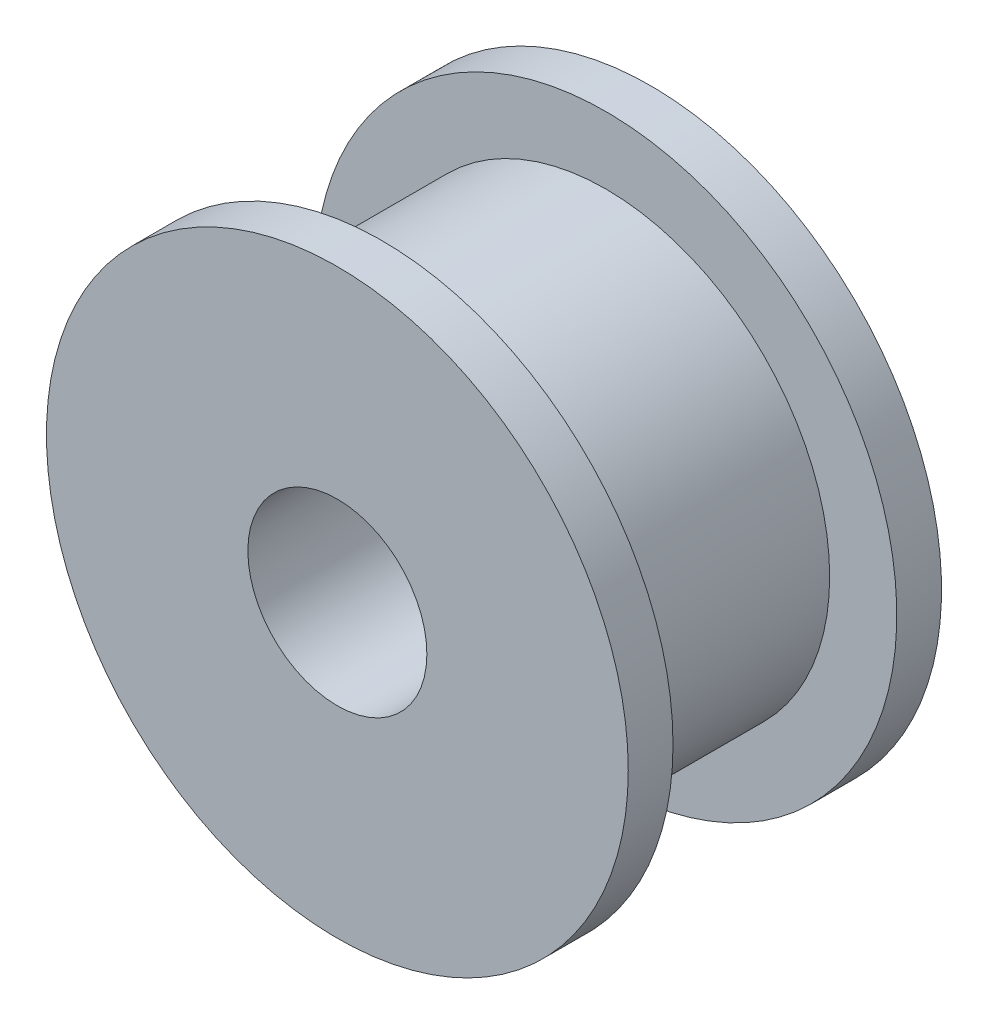
ISO-10303-21;
HEADER;
FILE_DESCRIPTION(('STEP AP214'),'2;1');
FILE_NAME('part.step','',(''),(''),'','','');
FILE_SCHEMA(('AUTOMOTIVE_DESIGN { 1 0 10303 214 1 1 1 1 }'));
ENDSEC;
DATA;
#1=APPLICATION_CONTEXT('core data for automotive mechanical design processes');
#2=APPLICATION_PROTOCOL_DEFINITION('international standard','automotive_design',2000,#1);
#3=PRODUCT_CONTEXT('',#1,'mechanical');
#4=PRODUCT('Part','Part','',(#3));
#5=PRODUCT_RELATED_PRODUCT_CATEGORY('part','',(#4));
#6=PRODUCT_DEFINITION_FORMATION('','',#4);
#7=PRODUCT_DEFINITION_CONTEXT('part definition',#1,'design');
#8=PRODUCT_DEFINITION('design','',#6,#7);
#9=PRODUCT_DEFINITION_SHAPE('','',#8);
#10=(LENGTH_UNIT() NAMED_UNIT(*) SI_UNIT(.MILLI.,.METRE.));
#11=(NAMED_UNIT(*) PLANE_ANGLE_UNIT() SI_UNIT($,.RADIAN.));
#12=(NAMED_UNIT(*) SI_UNIT($,.STERADIAN.) SOLID_ANGLE_UNIT());
#13=UNCERTAINTY_MEASURE_WITH_UNIT(LENGTH_MEASURE(1.E-05),#10,'distance_accuracy_value','');
#14=(GEOMETRIC_REPRESENTATION_CONTEXT(3) GLOBAL_UNCERTAINTY_ASSIGNED_CONTEXT((#13)) GLOBAL_UNIT_ASSIGNED_CONTEXT((#10,
#11,#12)) REPRESENTATION_CONTEXT('',''));
#15=CARTESIAN_POINT('',(0.,0.,0.));
#16=DIRECTION('',(0.,0.,1.));
#17=DIRECTION('',(1.,0.,0.));
#18=AXIS2_PLACEMENT_3D('',#15,#16,#17);
#19=CARTESIAN_POINT('',(0.,0.,2.5));
#20=DIRECTION('',(0.,0.,-1.));
#21=DIRECTION('',(-1.,0.,0.));
#22=AXIS2_PLACEMENT_3D('',#19,#20,#21);
#23=CYLINDRICAL_SURFACE('',#22,5.);
#24=CARTESIAN_POINT('',(0.,0.,2.5));
#25=DIRECTION('',(0.,0.,1.));
#26=DIRECTION('',(1.,0.,0.));
#27=AXIS2_PLACEMENT_3D('',#24,#25,#26);
#28=CIRCLE('',#27,5.);
#29=CARTESIAN_POINT('',(5.,0.,2.5));
#30=VERTEX_POINT('',#29);
#31=EDGE_CURVE('E10',#30,#30,#28,.T.);
#32=ORIENTED_EDGE('',*,*,#31,.F.);
#33=EDGE_LOOP('',(#32));
#34=FACE_BOUND('',#33,.T.);
#35=CARTESIAN_POINT('',(0.,0.,-2.5));
#36=DIRECTION('',(0.,0.,1.));
#37=DIRECTION('',(1.,0.,0.));
#38=AXIS2_PLACEMENT_3D('',#35,#36,#37);
#39=CIRCLE('',#38,5.);
#40=CARTESIAN_POINT('',(5.,0.,-2.5));
#41=VERTEX_POINT('',#40);
#42=EDGE_CURVE('E41',#41,#41,#39,.T.);
#43=ORIENTED_EDGE('',*,*,#42,.T.);
#44=EDGE_LOOP('',(#43));
#45=FACE_BOUND('',#44,.T.);
#46=ADVANCED_FACE('F38',(#34,#45),#23,.T.);
#47=CARTESIAN_POINT('',(0.,0.,2.5));
#48=DIRECTION('',(0.,0.,-1.));
#49=DIRECTION('',(-1.,0.,0.));
#50=AXIS2_PLACEMENT_3D('',#47,#48,#49);
#51=CYLINDRICAL_SURFACE('',#50,2.);
#52=CARTESIAN_POINT('',(0.,0.,-3.5));
#53=DIRECTION('',(0.,0.,-1.));
#54=DIRECTION('',(-1.,0.,0.));
#55=AXIS2_PLACEMENT_3D('',#52,#53,#54);
#56=CIRCLE('',#55,2.);
#57=CARTESIAN_POINT('',(-2.,0.,-3.5));
#58=VERTEX_POINT('',#57);
#59=EDGE_CURVE('E53',#58,#58,#56,.T.);
#60=ORIENTED_EDGE('',*,*,#59,.T.);
#61=EDGE_LOOP('',(#60));
#62=FACE_BOUND('',#61,.T.);
#63=CARTESIAN_POINT('',(0.,0.,3.5));
#64=DIRECTION('',(0.,0.,1.));
#65=DIRECTION('',(1.,0.,0.));
#66=AXIS2_PLACEMENT_3D('',#63,#64,#65);
#67=CIRCLE('',#66,2.);
#68=CARTESIAN_POINT('',(2.,0.,3.5));
#69=VERTEX_POINT('',#68);
#70=EDGE_CURVE('E62',#69,#69,#67,.T.);
#71=ORIENTED_EDGE('',*,*,#70,.T.);
#72=EDGE_LOOP('',(#71));
#73=FACE_BOUND('',#72,.T.);
#74=ADVANCED_FACE('F68',(#62,#73),#51,.F.);
#75=CARTESIAN_POINT('',(0.,0.,-3.5));
#76=DIRECTION('',(0.,0.,-1.));
#77=DIRECTION('',(-1.,0.,0.));
#78=AXIS2_PLACEMENT_3D('',#75,#76,#77);
#79=PLANE('',#78);
#80=CARTESIAN_POINT('',(0.,0.,-3.5));
#81=DIRECTION('',(0.,0.,-1.));
#82=DIRECTION('',(-1.,0.,0.));
#83=AXIS2_PLACEMENT_3D('',#80,#81,#82);
#84=CIRCLE('',#83,6.5);
#85=CARTESIAN_POINT('',(-6.5,0.,-3.5));
#86=VERTEX_POINT('',#85);
#87=EDGE_CURVE('E48',#86,#86,#84,.T.);
#88=ORIENTED_EDGE('',*,*,#87,.T.);
#89=EDGE_LOOP('',(#88));
#90=FACE_BOUND('',#89,.T.);
#91=ORIENTED_EDGE('',*,*,#59,.F.);
#92=EDGE_LOOP('',(#91));
#93=FACE_BOUND('',#92,.T.);
#94=ADVANCED_FACE('F90',(#90,#93),#79,.T.);
#95=CARTESIAN_POINT('',(0.,0.,-2.5));
#96=DIRECTION('',(0.,0.,-1.));
#97=DIRECTION('',(-1.,0.,0.));
#98=AXIS2_PLACEMENT_3D('',#95,#96,#97);
#99=PLANE('',#98);
#100=ORIENTED_EDGE('',*,*,#42,.F.);
#101=EDGE_LOOP('',(#100));
#102=FACE_BOUND('',#101,.T.);
#103=CARTESIAN_POINT('',(0.,0.,-2.5));
#104=DIRECTION('',(0.,0.,-1.));
#105=DIRECTION('',(-1.,0.,0.));
#106=AXIS2_PLACEMENT_3D('',#103,#104,#105);
#107=CIRCLE('',#106,6.5);
#108=CARTESIAN_POINT('',(-6.5,0.,-2.5));
#109=VERTEX_POINT('',#108);
#110=EDGE_CURVE('E50',#109,#109,#107,.T.);
#111=ORIENTED_EDGE('',*,*,#110,.F.);
#112=EDGE_LOOP('',(#111));
#113=FACE_BOUND('',#112,.T.);
#114=ADVANCED_FACE('F82',(#102,#113),#99,.F.);
#115=CARTESIAN_POINT('',(0.,0.,-3.5));
#116=DIRECTION('',(0.,0.,1.));
#117=DIRECTION('',(1.,0.,0.));
#118=AXIS2_PLACEMENT_3D('',#115,#116,#117);
#119=CYLINDRICAL_SURFACE('',#118,6.5);
#120=ORIENTED_EDGE('',*,*,#87,.F.);
#121=EDGE_LOOP('',(#120));
#122=FACE_BOUND('',#121,.T.);
#123=ORIENTED_EDGE('',*,*,#110,.T.);
#124=EDGE_LOOP('',(#123));
#125=FACE_BOUND('',#124,.T.);
#126=ADVANCED_FACE('F73',(#122,#125),#119,.T.);
#127=CARTESIAN_POINT('',(0.,0.,3.5));
#128=DIRECTION('',(0.,0.,1.));
#129=DIRECTION('',(1.,0.,0.));
#130=AXIS2_PLACEMENT_3D('',#127,#128,#129);
#131=PLANE('',#130);
#132=CARTESIAN_POINT('',(0.,0.,3.5));
#133=DIRECTION('',(0.,0.,1.));
#134=DIRECTION('',(1.,0.,0.));
#135=AXIS2_PLACEMENT_3D('',#132,#133,#134);
#136=CIRCLE('',#135,6.5);
#137=CARTESIAN_POINT('',(6.5,0.,3.5));
#138=VERTEX_POINT('',#137);
#139=EDGE_CURVE('E58',#138,#138,#136,.T.);
#140=ORIENTED_EDGE('',*,*,#139,.T.);
#141=EDGE_LOOP('',(#140));
#142=FACE_BOUND('',#141,.T.);
#143=ORIENTED_EDGE('',*,*,#70,.F.);
#144=EDGE_LOOP('',(#143));
#145=FACE_BOUND('',#144,.T.);
#146=ADVANCED_FACE('F70',(#142,#145),#131,.T.);
#147=CARTESIAN_POINT('',(0.,0.,2.5));
#148=DIRECTION('',(0.,0.,1.));
#149=DIRECTION('',(1.,0.,0.));
#150=AXIS2_PLACEMENT_3D('',#147,#148,#149);
#151=PLANE('',#150);
#152=ORIENTED_EDGE('',*,*,#31,.T.);
#153=EDGE_LOOP('',(#152));
#154=FACE_BOUND('',#153,.T.);
#155=CARTESIAN_POINT('',(0.,0.,2.5));
#156=DIRECTION('',(0.,0.,1.));
#157=DIRECTION('',(1.,0.,0.));
#158=AXIS2_PLACEMENT_3D('',#155,#156,#157);
#159=CIRCLE('',#158,6.5);
#160=CARTESIAN_POINT('',(6.5,0.,2.5));
#161=VERTEX_POINT('',#160);
#162=EDGE_CURVE('E59',#161,#161,#159,.T.);
#163=ORIENTED_EDGE('',*,*,#162,.F.);
#164=EDGE_LOOP('',(#163));
#165=FACE_BOUND('',#164,.T.);
#166=ADVANCED_FACE('F72',(#154,#165),#151,.F.);
#167=CARTESIAN_POINT('',(0.,0.,3.5));
#168=DIRECTION('',(0.,0.,-1.));
#169=DIRECTION('',(-1.,0.,0.));
#170=AXIS2_PLACEMENT_3D('',#167,#168,#169);
#171=CYLINDRICAL_SURFACE('',#170,6.5);
#172=ORIENTED_EDGE('',*,*,#139,.F.);
#173=EDGE_LOOP('',(#172));
#174=FACE_BOUND('',#173,.T.);
#175=ORIENTED_EDGE('',*,*,#162,.T.);
#176=EDGE_LOOP('',(#175));
#177=FACE_BOUND('',#176,.T.);
#178=ADVANCED_FACE('F80',(#174,#177),#171,.T.);
#179=CLOSED_SHELL('',(#46,#74,#94,#114,#126,#146,#166,#178));
#180=MANIFOLD_SOLID_BREP('B2',#179);
#181=ADVANCED_BREP_SHAPE_REPRESENTATION('',(#18,#180),#14);
#182=SHAPE_DEFINITION_REPRESENTATION(#9,#181);
ENDSEC;
END-ISO-10303-21;
